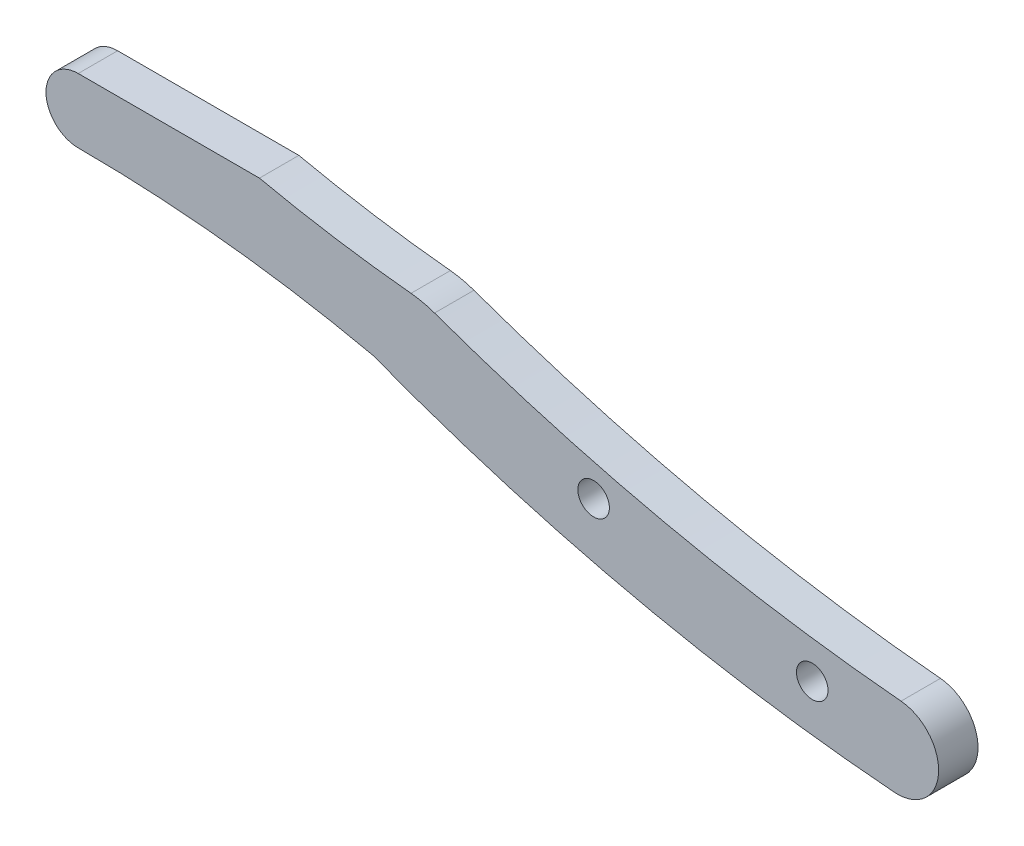
ISO-10303-21;
HEADER;
FILE_DESCRIPTION(('STEP AP214'),'2;1');
FILE_NAME('part.step','',(''),(''),'','','');
FILE_SCHEMA(('AUTOMOTIVE_DESIGN { 1 0 10303 214 1 1 1 1 }'));
ENDSEC;
DATA;
#1=APPLICATION_CONTEXT('core data for automotive mechanical design processes');
#2=APPLICATION_PROTOCOL_DEFINITION('international standard','automotive_design',2000,#1);
#3=PRODUCT_CONTEXT('',#1,'mechanical');
#4=PRODUCT('Part','Part','',(#3));
#5=PRODUCT_RELATED_PRODUCT_CATEGORY('part','',(#4));
#6=PRODUCT_DEFINITION_FORMATION('','',#4);
#7=PRODUCT_DEFINITION_CONTEXT('part definition',#1,'design');
#8=PRODUCT_DEFINITION('design','',#6,#7);
#9=PRODUCT_DEFINITION_SHAPE('','',#8);
#10=(LENGTH_UNIT() NAMED_UNIT(*) SI_UNIT(.MILLI.,.METRE.));
#11=(NAMED_UNIT(*) PLANE_ANGLE_UNIT() SI_UNIT($,.RADIAN.));
#12=(NAMED_UNIT(*) SI_UNIT($,.STERADIAN.) SOLID_ANGLE_UNIT());
#13=UNCERTAINTY_MEASURE_WITH_UNIT(LENGTH_MEASURE(1.E-05),#10,'distance_accuracy_value','');
#14=(GEOMETRIC_REPRESENTATION_CONTEXT(3) GLOBAL_UNCERTAINTY_ASSIGNED_CONTEXT((#13)) GLOBAL_UNIT_ASSIGNED_CONTEXT((#10,
#11,#12)) REPRESENTATION_CONTEXT('',''));
#15=CARTESIAN_POINT('',(0.,0.,0.));
#16=DIRECTION('',(0.,0.,1.));
#17=DIRECTION('',(1.,0.,0.));
#18=AXIS2_PLACEMENT_3D('',#15,#16,#17);
#19=CARTESIAN_POINT('',(8.63828640987588,-1.4055402315819,-62.1729279131992));
#20=DIRECTION('',(0.,0.,-1.));
#21=DIRECTION('',(-1.,0.,0.));
#22=AXIS2_PLACEMENT_3D('',#19,#20,#21);
#23=PLANE('',#22);
#24=CARTESIAN_POINT('',(8.63828640987588,-1.4055402315819,-62.1729279131992));
#25=DIRECTION('',(0.,0.,1.));
#26=DIRECTION('',(-1.,0.,0.));
#27=AXIS2_PLACEMENT_3D('',#24,#25,#26);
#28=CIRCLE('',#27,4.18950705413419);
#29=CARTESIAN_POINT('',(8.30586649398466,-5.58183839576526,-62.1729279131992));
#30=VERTEX_POINT('',#29);
#31=CARTESIAN_POINT('',(9.01347357308752,2.76713324584213,-62.1729279131992));
#32=VERTEX_POINT('',#31);
#33=EDGE_CURVE('E162',#30,#32,#28,.T.);
#34=ORIENTED_EDGE('',*,*,#33,.T.);
#35=CARTESIAN_POINT('',(26.114167883576,192.953846949675,-62.1729279131992));
#36=DIRECTION('',(0.,0.,-1.));
#37=DIRECTION('',(1.,0.,0.));
#38=AXIS2_PLACEMENT_3D('',#35,#36,#37);
#39=CIRCLE('',#38,190.953973028488);
#40=CARTESIAN_POINT('',(-38.33925284903,13.2063118588423,-62.1729279131992));
#41=VERTEX_POINT('',#40);
#42=EDGE_CURVE('E98',#32,#41,#39,.T.);
#43=ORIENTED_EDGE('',*,*,#42,.T.);
#44=CARTESIAN_POINT('',(-41.7145908799909,3.79317778050513,-62.1729279131992));
#45=DIRECTION('',(0.,0.,1.));
#46=DIRECTION('',(-1.,0.,0.));
#47=AXIS2_PLACEMENT_3D('',#44,#45,#46);
#48=CIRCLE('',#47,10.0000000000001);
#49=CARTESIAN_POINT('',(-40.7275822954006,13.7443492720405,-62.1729279131992));
#50=VERTEX_POINT('',#49);
#51=EDGE_CURVE('E183',#41,#50,#48,.T.);
#52=ORIENTED_EDGE('',*,*,#51,.T.);
#53=CARTESIAN_POINT('',(-27.4849699044576,147.258392569739,-62.1729279131992));
#54=DIRECTION('',(0.,0.,-1.));
#55=DIRECTION('',(-1.,0.,0.));
#56=AXIS2_PLACEMENT_3D('',#53,#54,#55);
#57=CIRCLE('',#56,134.169171349593);
#58=CARTESIAN_POINT('',(-56.1119065958764,16.178779218532,-62.1729279131992));
#59=VERTEX_POINT('',#58);
#60=EDGE_CURVE('E197',#50,#59,#57,.T.);
#61=ORIENTED_EDGE('',*,*,#60,.T.);
#62=DIRECTION('',(-1.,0.,0.));
#63=VECTOR('',#62,1.);
#64=CARTESIAN_POINT('',(-74.5054930313164,16.178779218532,-62.1729279131992));
#65=LINE('',#64,#63);
#66=CARTESIAN_POINT('',(-74.5054930313164,16.178779218532,-62.1729279131992));
#67=VERTEX_POINT('',#66);
#68=EDGE_CURVE('E117',#59,#67,#65,.T.);
#69=ORIENTED_EDGE('',*,*,#68,.T.);
#70=CARTESIAN_POINT('',(-74.5054930313164,12.9073576068301,-62.1729279131992));
#71=DIRECTION('',(0.,0.,1.));
#72=DIRECTION('',(1.,0.,0.));
#73=AXIS2_PLACEMENT_3D('',#70,#71,#72);
#74=CIRCLE('',#73,3.27142161170187);
#75=CARTESIAN_POINT('',(-74.5054930313164,9.63593599512826,-62.1729279131992));
#76=VERTEX_POINT('',#75);
#77=EDGE_CURVE('E111',#67,#76,#74,.T.);
#78=ORIENTED_EDGE('',*,*,#77,.T.);
#79=CARTESIAN_POINT('',(-74.5054930313158,-128.644417577761,-62.1729279131992));
#80=DIRECTION('',(0.,0.,-1.));
#81=DIRECTION('',(-1.,0.,0.));
#82=AXIS2_PLACEMENT_3D('',#79,#80,#81);
#83=CIRCLE('',#82,138.28035357289);
#84=CARTESIAN_POINT('',(-44.6470662848928,6.37384243351211,-62.1729279131992));
#85=VERTEX_POINT('',#84);
#86=EDGE_CURVE('E115',#76,#85,#83,.T.);
#87=ORIENTED_EDGE('',*,*,#86,.T.);
#88=CARTESIAN_POINT('',(23.4572680373106,184.770085255832,-62.1729279131992));
#89=DIRECTION('',(0.,0.,1.));
#90=DIRECTION('',(-1.,0.,0.));
#91=AXIS2_PLACEMENT_3D('',#88,#89,#90);
#92=CIRCLE('',#91,190.953973005514);
#93=EDGE_CURVE('E55',#85,#30,#92,.T.);
#94=ORIENTED_EDGE('',*,*,#93,.T.);
#95=EDGE_LOOP('',(#34,#43,#52,#61,#69,#78,#87,#94));
#96=FACE_BOUND('',#95,.T.);
#97=CARTESIAN_POINT('',(-9.5062846483529E-13,3.53883589099269E-13,-62.1729279131992));
#98=DIRECTION('',(0.,0.,1.));
#99=DIRECTION('',(1.,0.,0.));
#100=AXIS2_PLACEMENT_3D('',#97,#98,#99);
#101=CIRCLE('',#100,1.60000000000001);
#102=CARTESIAN_POINT('',(1.59999999999906,3.53883589099269E-13,-62.1729279131992));
#103=VERTEX_POINT('',#102);
#104=EDGE_CURVE('E144',#103,#103,#101,.T.);
#105=ORIENTED_EDGE('',*,*,#104,.F.);
#106=EDGE_LOOP('',(#105));
#107=FACE_BOUND('',#106,.T.);
#108=CARTESIAN_POINT('',(-22.1922241219609,4.95620946203623,-62.1729279131992));
#109=DIRECTION('',(0.,0.,1.));
#110=DIRECTION('',(1.,0.,0.));
#111=AXIS2_PLACEMENT_3D('',#108,#109,#110);
#112=CIRCLE('',#111,1.6);
#113=CARTESIAN_POINT('',(-20.5922241219609,4.95620946203623,-62.1729279131992));
#114=VERTEX_POINT('',#113);
#115=EDGE_CURVE('E211',#114,#114,#112,.T.);
#116=ORIENTED_EDGE('',*,*,#115,.F.);
#117=EDGE_LOOP('',(#116));
#118=FACE_BOUND('',#117,.T.);
#119=ADVANCED_FACE('F37',(#96,#107,#118),#23,.F.);
#120=CARTESIAN_POINT('',(8.63828640987588,-1.4055402315819,-66.1729279131992));
#121=DIRECTION('',(0.,0.,-1.));
#122=DIRECTION('',(-1.,0.,0.));
#123=AXIS2_PLACEMENT_3D('',#120,#121,#122);
#124=PLANE('',#123);
#125=CARTESIAN_POINT('',(-9.5062846483529E-13,3.53883589099269E-13,-66.1729279131992));
#126=DIRECTION('',(0.,0.,1.));
#127=DIRECTION('',(1.,0.,0.));
#128=AXIS2_PLACEMENT_3D('',#125,#126,#127);
#129=CIRCLE('',#128,1.60000000000001);
#130=CARTESIAN_POINT('',(1.59999999999906,3.53883589099269E-13,-66.1729279131992));
#131=VERTEX_POINT('',#130);
#132=EDGE_CURVE('E207',#131,#131,#129,.T.);
#133=ORIENTED_EDGE('',*,*,#132,.T.);
#134=EDGE_LOOP('',(#133));
#135=FACE_BOUND('',#134,.T.);
#136=CARTESIAN_POINT('',(8.63828640987588,-1.4055402315819,-66.1729279131992));
#137=DIRECTION('',(0.,0.,1.));
#138=DIRECTION('',(-1.,0.,0.));
#139=AXIS2_PLACEMENT_3D('',#136,#137,#138);
#140=CIRCLE('',#139,4.18950705413419);
#141=CARTESIAN_POINT('',(8.30586649398466,-5.58183839576526,-66.1729279131992));
#142=VERTEX_POINT('',#141);
#143=CARTESIAN_POINT('',(9.01347357308752,2.76713324584213,-66.1729279131992));
#144=VERTEX_POINT('',#143);
#145=EDGE_CURVE('E139',#142,#144,#140,.T.);
#146=ORIENTED_EDGE('',*,*,#145,.F.);
#147=CARTESIAN_POINT('',(23.4572680373106,184.770085255832,-66.1729279131992));
#148=DIRECTION('',(0.,0.,1.));
#149=DIRECTION('',(-1.,0.,0.));
#150=AXIS2_PLACEMENT_3D('',#147,#148,#149);
#151=CIRCLE('',#150,190.953973005514);
#152=CARTESIAN_POINT('',(-44.6470662848928,6.37384243351211,-66.1729279131992));
#153=VERTEX_POINT('',#152);
#154=EDGE_CURVE('E90',#153,#142,#151,.T.);
#155=ORIENTED_EDGE('',*,*,#154,.F.);
#156=CARTESIAN_POINT('',(-74.5054930313158,-128.644417577761,-66.1729279131992));
#157=DIRECTION('',(0.,0.,-1.));
#158=DIRECTION('',(-1.,0.,0.));
#159=AXIS2_PLACEMENT_3D('',#156,#157,#158);
#160=CIRCLE('',#159,138.28035357289);
#161=CARTESIAN_POINT('',(-74.5054930313164,9.63593599512826,-66.1729279131992));
#162=VERTEX_POINT('',#161);
#163=EDGE_CURVE('E84',#162,#153,#160,.T.);
#164=ORIENTED_EDGE('',*,*,#163,.F.);
#165=CARTESIAN_POINT('',(-74.5054930313164,12.9073576068301,-66.1729279131992));
#166=DIRECTION('',(0.,0.,1.));
#167=DIRECTION('',(1.,0.,0.));
#168=AXIS2_PLACEMENT_3D('',#165,#166,#167);
#169=CIRCLE('',#168,3.27142161170187);
#170=CARTESIAN_POINT('',(-74.5054930313164,16.178779218532,-66.1729279131992));
#171=VERTEX_POINT('',#170);
#172=EDGE_CURVE('E126',#171,#162,#169,.T.);
#173=ORIENTED_EDGE('',*,*,#172,.F.);
#174=DIRECTION('',(-1.,0.,0.));
#175=VECTOR('',#174,1.);
#176=CARTESIAN_POINT('',(-74.5054930313164,16.178779218532,-66.1729279131992));
#177=LINE('',#176,#175);
#178=CARTESIAN_POINT('',(-56.1119065958764,16.178779218532,-66.1729279131992));
#179=VERTEX_POINT('',#178);
#180=EDGE_CURVE('E153',#179,#171,#177,.T.);
#181=ORIENTED_EDGE('',*,*,#180,.F.);
#182=CARTESIAN_POINT('',(-27.4849699044576,147.258392569739,-66.1729279131992));
#183=DIRECTION('',(0.,0.,-1.));
#184=DIRECTION('',(-1.,0.,0.));
#185=AXIS2_PLACEMENT_3D('',#182,#183,#184);
#186=CIRCLE('',#185,134.169171349593);
#187=CARTESIAN_POINT('',(-40.7275822954006,13.7443492720405,-66.1729279131992));
#188=VERTEX_POINT('',#187);
#189=EDGE_CURVE('E150',#188,#179,#186,.T.);
#190=ORIENTED_EDGE('',*,*,#189,.F.);
#191=CARTESIAN_POINT('',(-41.7145908799909,3.79317778050513,-66.1729279131992));
#192=DIRECTION('',(0.,0.,1.));
#193=DIRECTION('',(-1.,0.,0.));
#194=AXIS2_PLACEMENT_3D('',#191,#192,#193);
#195=CIRCLE('',#194,10.0000000000001);
#196=CARTESIAN_POINT('',(-38.33925284903,13.2063118588423,-66.1729279131992));
#197=VERTEX_POINT('',#196);
#198=EDGE_CURVE('E147',#197,#188,#195,.T.);
#199=ORIENTED_EDGE('',*,*,#198,.F.);
#200=CARTESIAN_POINT('',(26.114167883576,192.953846949675,-66.1729279131992));
#201=DIRECTION('',(0.,0.,-1.));
#202=DIRECTION('',(1.,0.,0.));
#203=AXIS2_PLACEMENT_3D('',#200,#201,#202);
#204=CIRCLE('',#203,190.953973028488);
#205=EDGE_CURVE('E143',#144,#197,#204,.T.);
#206=ORIENTED_EDGE('',*,*,#205,.F.);
#207=EDGE_LOOP('',(#146,#155,#164,#173,#181,#190,#199,#206));
#208=FACE_BOUND('',#207,.T.);
#209=CARTESIAN_POINT('',(-22.1922241219609,4.95620946203623,-66.1729279131992));
#210=DIRECTION('',(0.,0.,1.));
#211=DIRECTION('',(1.,0.,0.));
#212=AXIS2_PLACEMENT_3D('',#209,#210,#211);
#213=CIRCLE('',#212,1.6);
#214=CARTESIAN_POINT('',(-20.5922241219609,4.95620946203623,-66.1729279131992));
#215=VERTEX_POINT('',#214);
#216=EDGE_CURVE('E215',#215,#215,#213,.T.);
#217=ORIENTED_EDGE('',*,*,#216,.T.);
#218=EDGE_LOOP('',(#217));
#219=FACE_BOUND('',#218,.T.);
#220=ADVANCED_FACE('F187',(#135,#208,#219),#124,.T.);
#221=CARTESIAN_POINT('',(8.63828640987588,-1.4055402315819,-62.1729279131992));
#222=DIRECTION('',(0.,0.,-1.));
#223=DIRECTION('',(-1.,0.,0.));
#224=AXIS2_PLACEMENT_3D('',#221,#222,#223);
#225=CYLINDRICAL_SURFACE('',#224,4.18950705413419);
#226=ORIENTED_EDGE('',*,*,#145,.T.);
#227=DIRECTION('',(0.,0.,-1.));
#228=VECTOR('',#227,1.);
#229=CARTESIAN_POINT('',(9.01347357308752,2.76713324584213,-62.1729279131992));
#230=LINE('',#229,#228);
#231=EDGE_CURVE('E11',#32,#144,#230,.T.);
#232=ORIENTED_EDGE('',*,*,#231,.F.);
#233=ORIENTED_EDGE('',*,*,#33,.F.);
#234=DIRECTION('',(0.,0.,-1.));
#235=VECTOR('',#234,1.);
#236=CARTESIAN_POINT('',(8.30586649398466,-5.58183839576526,-62.1729279131992));
#237=LINE('',#236,#235);
#238=EDGE_CURVE('E135',#30,#142,#237,.T.);
#239=ORIENTED_EDGE('',*,*,#238,.T.);
#240=EDGE_LOOP('',(#226,#232,#233,#239));
#241=FACE_BOUND('',#240,.T.);
#242=ADVANCED_FACE('F39',(#241),#225,.T.);
#243=CARTESIAN_POINT('',(26.114167883576,192.953846949675,-62.1729279131992));
#244=DIRECTION('',(0.,0.,-1.));
#245=DIRECTION('',(-1.,0.,0.));
#246=AXIS2_PLACEMENT_3D('',#243,#244,#245);
#247=CYLINDRICAL_SURFACE('',#246,190.953973028488);
#248=ORIENTED_EDGE('',*,*,#205,.T.);
#249=DIRECTION('',(0.,0.,-1.));
#250=VECTOR('',#249,1.);
#251=CARTESIAN_POINT('',(-38.33925284903,13.2063118588423,-62.1729279131992));
#252=LINE('',#251,#250);
#253=EDGE_CURVE('E47',#41,#197,#252,.T.);
#254=ORIENTED_EDGE('',*,*,#253,.F.);
#255=ORIENTED_EDGE('',*,*,#42,.F.);
#256=ORIENTED_EDGE('',*,*,#231,.T.);
#257=EDGE_LOOP('',(#248,#254,#255,#256));
#258=FACE_BOUND('',#257,.T.);
#259=ADVANCED_FACE('F249',(#258),#247,.F.);
#260=CARTESIAN_POINT('',(-41.7145908799909,3.79317778050513,-62.1729279131992));
#261=DIRECTION('',(0.,0.,-1.));
#262=DIRECTION('',(-1.,0.,0.));
#263=AXIS2_PLACEMENT_3D('',#260,#261,#262);
#264=CYLINDRICAL_SURFACE('',#263,10.0000000000001);
#265=ORIENTED_EDGE('',*,*,#198,.T.);
#266=DIRECTION('',(0.,0.,-1.));
#267=VECTOR('',#266,1.);
#268=CARTESIAN_POINT('',(-40.7275822954006,13.7443492720405,-62.1729279131992));
#269=LINE('',#268,#267);
#270=EDGE_CURVE('E173',#50,#188,#269,.T.);
#271=ORIENTED_EDGE('',*,*,#270,.F.);
#272=ORIENTED_EDGE('',*,*,#51,.F.);
#273=ORIENTED_EDGE('',*,*,#253,.T.);
#274=EDGE_LOOP('',(#265,#271,#272,#273));
#275=FACE_BOUND('',#274,.T.);
#276=ADVANCED_FACE('F181',(#275),#264,.T.);
#277=CARTESIAN_POINT('',(-27.4849699044576,147.258392569739,-62.1729279131992));
#278=DIRECTION('',(0.,0.,-1.));
#279=DIRECTION('',(-1.,0.,0.));
#280=AXIS2_PLACEMENT_3D('',#277,#278,#279);
#281=CYLINDRICAL_SURFACE('',#280,134.169171349593);
#282=ORIENTED_EDGE('',*,*,#189,.T.);
#283=DIRECTION('',(0.,0.,-1.));
#284=VECTOR('',#283,1.);
#285=CARTESIAN_POINT('',(-56.1119065958764,16.178779218532,-62.1729279131992));
#286=LINE('',#285,#284);
#287=EDGE_CURVE('E169',#59,#179,#286,.T.);
#288=ORIENTED_EDGE('',*,*,#287,.F.);
#289=ORIENTED_EDGE('',*,*,#60,.F.);
#290=ORIENTED_EDGE('',*,*,#270,.T.);
#291=EDGE_LOOP('',(#282,#288,#289,#290));
#292=FACE_BOUND('',#291,.T.);
#293=ADVANCED_FACE('F192',(#292),#281,.F.);
#294=CARTESIAN_POINT('',(-74.5054930313164,16.178779218532,-62.1729279131992));
#295=DIRECTION('',(0.,-1.,0.));
#296=DIRECTION('',(1.,0.,0.));
#297=AXIS2_PLACEMENT_3D('',#294,#295,#296);
#298=PLANE('',#297);
#299=ORIENTED_EDGE('',*,*,#180,.T.);
#300=DIRECTION('',(0.,0.,-1.));
#301=VECTOR('',#300,1.);
#302=CARTESIAN_POINT('',(-74.5054930313164,16.178779218532,-62.1729279131992));
#303=LINE('',#302,#301);
#304=EDGE_CURVE('E128',#67,#171,#303,.T.);
#305=ORIENTED_EDGE('',*,*,#304,.F.);
#306=ORIENTED_EDGE('',*,*,#68,.F.);
#307=ORIENTED_EDGE('',*,*,#287,.T.);
#308=EDGE_LOOP('',(#299,#305,#306,#307));
#309=FACE_BOUND('',#308,.T.);
#310=ADVANCED_FACE('F195',(#309),#298,.F.);
#311=CARTESIAN_POINT('',(-74.5054930313164,12.9073576068301,-62.1729279131992));
#312=DIRECTION('',(0.,0.,-1.));
#313=DIRECTION('',(-1.,0.,0.));
#314=AXIS2_PLACEMENT_3D('',#311,#312,#313);
#315=CYLINDRICAL_SURFACE('',#314,3.27142161170187);
#316=ORIENTED_EDGE('',*,*,#172,.T.);
#317=DIRECTION('',(0.,0.,-1.));
#318=VECTOR('',#317,1.);
#319=CARTESIAN_POINT('',(-74.5054930313164,9.63593599512826,-62.1729279131992));
#320=LINE('',#319,#318);
#321=EDGE_CURVE('E123',#76,#162,#320,.T.);
#322=ORIENTED_EDGE('',*,*,#321,.F.);
#323=ORIENTED_EDGE('',*,*,#77,.F.);
#324=ORIENTED_EDGE('',*,*,#304,.T.);
#325=EDGE_LOOP('',(#316,#322,#323,#324));
#326=FACE_BOUND('',#325,.T.);
#327=ADVANCED_FACE('F124',(#326),#315,.T.);
#328=CARTESIAN_POINT('',(-74.5054930313158,-128.644417577761,-62.1729279131992));
#329=DIRECTION('',(0.,0.,-1.));
#330=DIRECTION('',(-1.,0.,0.));
#331=AXIS2_PLACEMENT_3D('',#328,#329,#330);
#332=CYLINDRICAL_SURFACE('',#331,138.28035357289);
#333=ORIENTED_EDGE('',*,*,#163,.T.);
#334=DIRECTION('',(0.,0.,-1.));
#335=VECTOR('',#334,1.);
#336=CARTESIAN_POINT('',(-44.6470662848928,6.37384243351211,-62.1729279131992));
#337=LINE('',#336,#335);
#338=EDGE_CURVE('E129',#85,#153,#337,.T.);
#339=ORIENTED_EDGE('',*,*,#338,.F.);
#340=ORIENTED_EDGE('',*,*,#86,.F.);
#341=ORIENTED_EDGE('',*,*,#321,.T.);
#342=EDGE_LOOP('',(#333,#339,#340,#341));
#343=FACE_BOUND('',#342,.T.);
#344=ADVANCED_FACE('F131',(#343),#332,.F.);
#345=CARTESIAN_POINT('',(23.4572680373106,184.770085255832,-62.1729279131992));
#346=DIRECTION('',(0.,0.,-1.));
#347=DIRECTION('',(-1.,0.,0.));
#348=AXIS2_PLACEMENT_3D('',#345,#346,#347);
#349=CYLINDRICAL_SURFACE('',#348,190.953973005514);
#350=ORIENTED_EDGE('',*,*,#154,.T.);
#351=ORIENTED_EDGE('',*,*,#238,.F.);
#352=ORIENTED_EDGE('',*,*,#93,.F.);
#353=ORIENTED_EDGE('',*,*,#338,.T.);
#354=EDGE_LOOP('',(#350,#351,#352,#353));
#355=FACE_BOUND('',#354,.T.);
#356=ADVANCED_FACE('F237',(#355),#349,.T.);
#357=CARTESIAN_POINT('',(-9.5062846483529E-13,3.53883589099269E-13,-62.1729279131992));
#358=DIRECTION('',(0.,0.,-1.));
#359=DIRECTION('',(-1.,0.,0.));
#360=AXIS2_PLACEMENT_3D('',#357,#358,#359);
#361=CYLINDRICAL_SURFACE('',#360,1.60000000000001);
#362=ORIENTED_EDGE('',*,*,#104,.T.);
#363=EDGE_LOOP('',(#362));
#364=FACE_BOUND('',#363,.T.);
#365=ORIENTED_EDGE('',*,*,#132,.F.);
#366=EDGE_LOOP('',(#365));
#367=FACE_BOUND('',#366,.T.);
#368=ADVANCED_FACE('F234',(#364,#367),#361,.F.);
#369=CARTESIAN_POINT('',(-22.1922241219609,4.95620946203623,-62.1729279131992));
#370=DIRECTION('',(0.,0.,-1.));
#371=DIRECTION('',(-1.,0.,0.));
#372=AXIS2_PLACEMENT_3D('',#369,#370,#371);
#373=CYLINDRICAL_SURFACE('',#372,1.6);
#374=ORIENTED_EDGE('',*,*,#115,.T.);
#375=EDGE_LOOP('',(#374));
#376=FACE_BOUND('',#375,.T.);
#377=ORIENTED_EDGE('',*,*,#216,.F.);
#378=EDGE_LOOP('',(#377));
#379=FACE_BOUND('',#378,.T.);
#380=ADVANCED_FACE('F223',(#376,#379),#373,.F.);
#381=CLOSED_SHELL('',(#119,#220,#242,#259,#276,#293,#310,#327,#344,#356,#368,#380));
#382=MANIFOLD_SOLID_BREP('B2',#381);
#383=ADVANCED_BREP_SHAPE_REPRESENTATION('',(#18,#382),#14);
#384=SHAPE_DEFINITION_REPRESENTATION(#9,#383);
ENDSEC;
END-ISO-10303-21;
